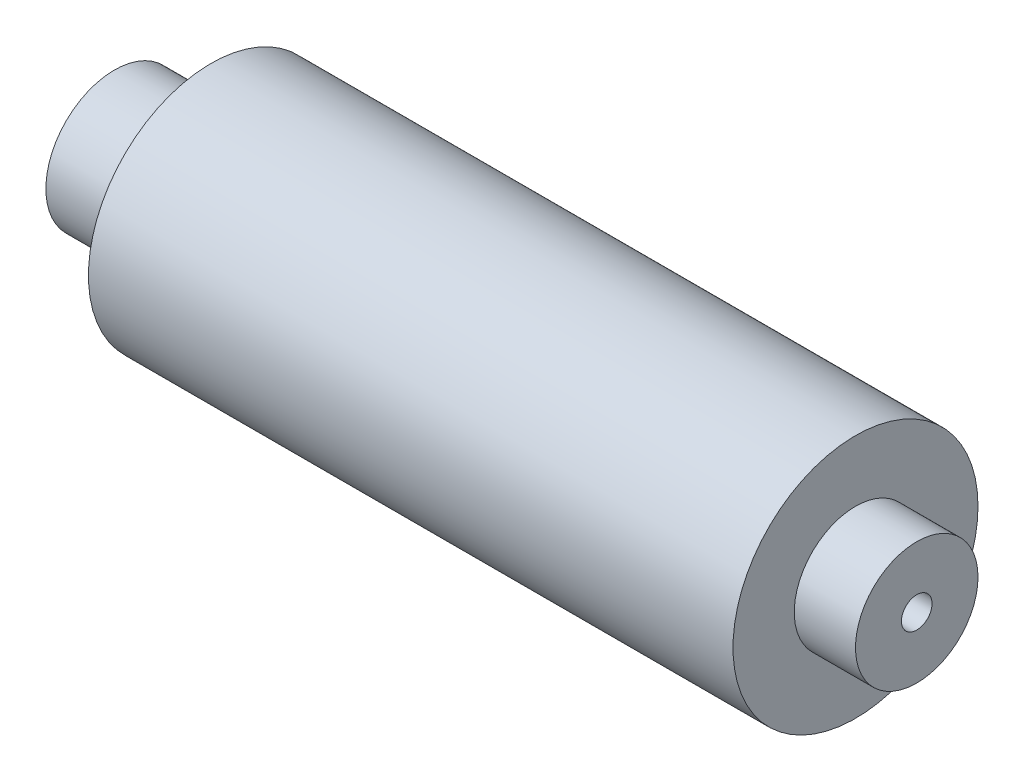
ISO-10303-21;
HEADER;
FILE_DESCRIPTION(('STEP AP214'),'2;1');
FILE_NAME('part.step','',(''),(''),'','','');
FILE_SCHEMA(('AUTOMOTIVE_DESIGN { 1 0 10303 214 1 1 1 1 }'));
ENDSEC;
DATA;
#1=APPLICATION_CONTEXT('core data for automotive mechanical design processes');
#2=APPLICATION_PROTOCOL_DEFINITION('international standard','automotive_design',2000,#1);
#3=PRODUCT_CONTEXT('',#1,'mechanical');
#4=PRODUCT('Part','Part','',(#3));
#5=PRODUCT_RELATED_PRODUCT_CATEGORY('part','',(#4));
#6=PRODUCT_DEFINITION_FORMATION('','',#4);
#7=PRODUCT_DEFINITION_CONTEXT('part definition',#1,'design');
#8=PRODUCT_DEFINITION('design','',#6,#7);
#9=PRODUCT_DEFINITION_SHAPE('','',#8);
#10=(LENGTH_UNIT() NAMED_UNIT(*) SI_UNIT(.MILLI.,.METRE.));
#11=(NAMED_UNIT(*) PLANE_ANGLE_UNIT() SI_UNIT($,.RADIAN.));
#12=(NAMED_UNIT(*) SI_UNIT($,.STERADIAN.) SOLID_ANGLE_UNIT());
#13=UNCERTAINTY_MEASURE_WITH_UNIT(LENGTH_MEASURE(1.E-05),#10,'distance_accuracy_value','');
#14=(GEOMETRIC_REPRESENTATION_CONTEXT(3) GLOBAL_UNCERTAINTY_ASSIGNED_CONTEXT((#13)) GLOBAL_UNIT_ASSIGNED_CONTEXT((#10,
#11,#12)) REPRESENTATION_CONTEXT('',''));
#15=CARTESIAN_POINT('',(0.,0.,0.));
#16=DIRECTION('',(0.,0.,1.));
#17=DIRECTION('',(1.,0.,0.));
#18=AXIS2_PLACEMENT_3D('',#15,#16,#17);
#19=CARTESIAN_POINT('',(0.,0.,0.));
#20=DIRECTION('',(1.,0.,0.));
#21=DIRECTION('',(0.,0.,-1.));
#22=AXIS2_PLACEMENT_3D('',#19,#20,#21);
#23=CYLINDRICAL_SURFACE('',#22,2.38125);
#24=CARTESIAN_POINT('',(10.,0.,0.));
#25=DIRECTION('',(1.,0.,0.));
#26=DIRECTION('',(0.,0.,-1.));
#27=AXIS2_PLACEMENT_3D('',#24,#25,#26);
#28=CIRCLE('',#27,2.38125);
#29=CARTESIAN_POINT('',(10.,0.,-2.38125));
#30=VERTEX_POINT('',#29);
#31=EDGE_CURVE('E65',#30,#30,#28,.T.);
#32=ORIENTED_EDGE('',*,*,#31,.T.);
#33=EDGE_LOOP('',(#32));
#34=FACE_BOUND('',#33,.T.);
#35=CARTESIAN_POINT('',(0.,0.,0.));
#36=DIRECTION('',(1.,0.,0.));
#37=DIRECTION('',(0.,0.,-1.));
#38=AXIS2_PLACEMENT_3D('',#35,#36,#37);
#39=CIRCLE('',#38,2.38125);
#40=CARTESIAN_POINT('',(0.,0.,-2.38125));
#41=VERTEX_POINT('',#40);
#42=EDGE_CURVE('E10',#41,#41,#39,.T.);
#43=ORIENTED_EDGE('',*,*,#42,.F.);
#44=EDGE_LOOP('',(#43));
#45=FACE_BOUND('',#44,.T.);
#46=ADVANCED_FACE('F31',(#34,#45),#23,.F.);
#47=CARTESIAN_POINT('',(0.,0.,-2.38125));
#48=DIRECTION('',(-1.,0.,0.));
#49=DIRECTION('',(0.,0.,1.));
#50=AXIS2_PLACEMENT_3D('',#47,#48,#49);
#51=PLANE('',#50);
#52=ORIENTED_EDGE('',*,*,#42,.T.);
#53=EDGE_LOOP('',(#52));
#54=FACE_BOUND('',#53,.T.);
#55=CARTESIAN_POINT('',(0.,0.,0.));
#56=DIRECTION('',(1.,0.,0.));
#57=DIRECTION('',(0.,0.,-1.));
#58=AXIS2_PLACEMENT_3D('',#55,#56,#57);
#59=CIRCLE('',#58,3.556);
#60=CARTESIAN_POINT('',(0.,0.,-3.556));
#61=VERTEX_POINT('',#60);
#62=EDGE_CURVE('E37',#61,#61,#59,.T.);
#63=ORIENTED_EDGE('',*,*,#62,.F.);
#64=EDGE_LOOP('',(#63));
#65=FACE_BOUND('',#64,.T.);
#66=ADVANCED_FACE('F83',(#54,#65),#51,.T.);
#67=CARTESIAN_POINT('',(0.,0.,0.));
#68=DIRECTION('',(1.,0.,0.));
#69=DIRECTION('',(0.,0.,-1.));
#70=AXIS2_PLACEMENT_3D('',#67,#68,#69);
#71=CYLINDRICAL_SURFACE('',#70,3.556);
#72=ORIENTED_EDGE('',*,*,#62,.T.);
#73=EDGE_LOOP('',(#72));
#74=FACE_BOUND('',#73,.T.);
#75=CARTESIAN_POINT('',(5.,0.,0.));
#76=DIRECTION('',(1.,0.,0.));
#77=DIRECTION('',(0.,0.,-1.));
#78=AXIS2_PLACEMENT_3D('',#75,#76,#77);
#79=CIRCLE('',#78,3.556);
#80=CARTESIAN_POINT('',(5.,0.,-3.556));
#81=VERTEX_POINT('',#80);
#82=EDGE_CURVE('E41',#81,#81,#79,.T.);
#83=ORIENTED_EDGE('',*,*,#82,.F.);
#84=EDGE_LOOP('',(#83));
#85=FACE_BOUND('',#84,.T.);
#86=ADVANCED_FACE('F87',(#74,#85),#71,.T.);
#87=CARTESIAN_POINT('',(5.,0.,-3.556));
#88=DIRECTION('',(-1.,0.,0.));
#89=DIRECTION('',(0.,0.,1.));
#90=AXIS2_PLACEMENT_3D('',#87,#88,#89);
#91=PLANE('',#90);
#92=ORIENTED_EDGE('',*,*,#82,.T.);
#93=EDGE_LOOP('',(#92));
#94=FACE_BOUND('',#93,.T.);
#95=CARTESIAN_POINT('',(5.,0.,0.));
#96=DIRECTION('',(1.,0.,0.));
#97=DIRECTION('',(0.,0.,-1.));
#98=AXIS2_PLACEMENT_3D('',#95,#96,#97);
#99=CIRCLE('',#98,6.35);
#100=CARTESIAN_POINT('',(5.,0.,-6.35));
#101=VERTEX_POINT('',#100);
#102=EDGE_CURVE('E45',#101,#101,#99,.T.);
#103=ORIENTED_EDGE('',*,*,#102,.F.);
#104=EDGE_LOOP('',(#103));
#105=FACE_BOUND('',#104,.T.);
#106=ADVANCED_FACE('F91',(#94,#105),#91,.T.);
#107=CARTESIAN_POINT('',(0.,0.,0.));
#108=DIRECTION('',(1.,0.,0.));
#109=DIRECTION('',(0.,0.,-1.));
#110=AXIS2_PLACEMENT_3D('',#107,#108,#109);
#111=CYLINDRICAL_SURFACE('',#110,6.35);
#112=ORIENTED_EDGE('',*,*,#102,.T.);
#113=EDGE_LOOP('',(#112));
#114=FACE_BOUND('',#113,.T.);
#115=CARTESIAN_POINT('',(38.4125,0.,0.));
#116=DIRECTION('',(1.,0.,0.));
#117=DIRECTION('',(0.,0.,-1.));
#118=AXIS2_PLACEMENT_3D('',#115,#116,#117);
#119=CIRCLE('',#118,6.34999999999999);
#120=CARTESIAN_POINT('',(38.4125,0.,-6.35));
#121=VERTEX_POINT('',#120);
#122=EDGE_CURVE('E50',#121,#121,#119,.T.);
#123=ORIENTED_EDGE('',*,*,#122,.F.);
#124=EDGE_LOOP('',(#123));
#125=FACE_BOUND('',#124,.T.);
#126=ADVANCED_FACE('F97',(#114,#125),#111,.T.);
#127=CARTESIAN_POINT('',(38.4125,0.,-6.35));
#128=DIRECTION('',(1.,0.,0.));
#129=DIRECTION('',(0.,0.,-1.));
#130=AXIS2_PLACEMENT_3D('',#127,#128,#129);
#131=PLANE('',#130);
#132=ORIENTED_EDGE('',*,*,#122,.T.);
#133=EDGE_LOOP('',(#132));
#134=FACE_BOUND('',#133,.T.);
#135=CARTESIAN_POINT('',(38.4125,0.,0.));
#136=DIRECTION('',(1.,0.,0.));
#137=DIRECTION('',(0.,0.,-1.));
#138=AXIS2_PLACEMENT_3D('',#135,#136,#137);
#139=CIRCLE('',#138,3.175);
#140=CARTESIAN_POINT('',(38.4125,0.,-3.17500000000001));
#141=VERTEX_POINT('',#140);
#142=EDGE_CURVE('E53',#141,#141,#139,.T.);
#143=ORIENTED_EDGE('',*,*,#142,.F.);
#144=EDGE_LOOP('',(#143));
#145=FACE_BOUND('',#144,.T.);
#146=ADVANCED_FACE('F101',(#134,#145),#131,.T.);
#147=CARTESIAN_POINT('',(0.,0.,0.));
#148=DIRECTION('',(1.,0.,0.));
#149=DIRECTION('',(0.,0.,-1.));
#150=AXIS2_PLACEMENT_3D('',#147,#148,#149);
#151=CYLINDRICAL_SURFACE('',#150,3.175);
#152=ORIENTED_EDGE('',*,*,#142,.T.);
#153=EDGE_LOOP('',(#152));
#154=FACE_BOUND('',#153,.T.);
#155=CARTESIAN_POINT('',(41.5875,0.,0.));
#156=DIRECTION('',(1.,0.,0.));
#157=DIRECTION('',(0.,0.,-1.));
#158=AXIS2_PLACEMENT_3D('',#155,#156,#157);
#159=CIRCLE('',#158,3.175);
#160=CARTESIAN_POINT('',(41.5875,0.,-3.17500000000001));
#161=VERTEX_POINT('',#160);
#162=EDGE_CURVE('E56',#161,#161,#159,.T.);
#163=ORIENTED_EDGE('',*,*,#162,.F.);
#164=EDGE_LOOP('',(#163));
#165=FACE_BOUND('',#164,.T.);
#166=ADVANCED_FACE('F105',(#154,#165),#151,.T.);
#167=CARTESIAN_POINT('',(41.5875,0.,-3.17500000000001));
#168=DIRECTION('',(1.,0.,0.));
#169=DIRECTION('',(0.,0.,-1.));
#170=AXIS2_PLACEMENT_3D('',#167,#168,#169);
#171=PLANE('',#170);
#172=ORIENTED_EDGE('',*,*,#162,.T.);
#173=EDGE_LOOP('',(#172));
#174=FACE_BOUND('',#173,.T.);
#175=CARTESIAN_POINT('',(41.5875,0.,0.));
#176=DIRECTION('',(1.,0.,0.));
#177=DIRECTION('',(0.,0.,-1.));
#178=AXIS2_PLACEMENT_3D('',#175,#176,#177);
#179=CIRCLE('',#178,0.79375);
#180=CARTESIAN_POINT('',(41.5875,0.,-0.793750000000005));
#181=VERTEX_POINT('',#180);
#182=EDGE_CURVE('E59',#181,#181,#179,.T.);
#183=ORIENTED_EDGE('',*,*,#182,.F.);
#184=EDGE_LOOP('',(#183));
#185=FACE_BOUND('',#184,.T.);
#186=ADVANCED_FACE('F79',(#174,#185),#171,.T.);
#187=CARTESIAN_POINT('',(0.,0.,0.));
#188=DIRECTION('',(1.,0.,0.));
#189=DIRECTION('',(0.,0.,-1.));
#190=AXIS2_PLACEMENT_3D('',#187,#188,#189);
#191=CYLINDRICAL_SURFACE('',#190,0.79375);
#192=ORIENTED_EDGE('',*,*,#182,.T.);
#193=EDGE_LOOP('',(#192));
#194=FACE_BOUND('',#193,.T.);
#195=CARTESIAN_POINT('',(11.5875,0.,0.));
#196=DIRECTION('',(1.,0.,0.));
#197=DIRECTION('',(0.,0.,-1.));
#198=AXIS2_PLACEMENT_3D('',#195,#196,#197);
#199=CIRCLE('',#198,0.79375);
#200=CARTESIAN_POINT('',(11.5875,0.,-0.793750000000001));
#201=VERTEX_POINT('',#200);
#202=EDGE_CURVE('E62',#201,#201,#199,.T.);
#203=ORIENTED_EDGE('',*,*,#202,.F.);
#204=EDGE_LOOP('',(#203));
#205=FACE_BOUND('',#204,.T.);
#206=ADVANCED_FACE('F73',(#194,#205),#191,.F.);
#207=CARTESIAN_POINT('',(10.,0.,0.));
#208=DIRECTION('',(-1.,0.,0.));
#209=DIRECTION('',(0.,0.,1.));
#210=AXIS2_PLACEMENT_3D('',#207,#208,#209);
#211=CONICAL_SURFACE('',#210,2.38125,0.785398163397434);
#212=ORIENTED_EDGE('',*,*,#202,.T.);
#213=EDGE_LOOP('',(#212));
#214=FACE_BOUND('',#213,.T.);
#215=ORIENTED_EDGE('',*,*,#31,.F.);
#216=EDGE_LOOP('',(#215));
#217=FACE_BOUND('',#216,.T.);
#218=ADVANCED_FACE('F71',(#214,#217),#211,.F.);
#219=CLOSED_SHELL('',(#46,#66,#86,#106,#126,#146,#166,#186,#206,#218));
#220=MANIFOLD_SOLID_BREP('B2',#219);
#221=ADVANCED_BREP_SHAPE_REPRESENTATION('',(#18,#220),#14);
#222=SHAPE_DEFINITION_REPRESENTATION(#9,#221);
ENDSEC;
END-ISO-10303-21;
